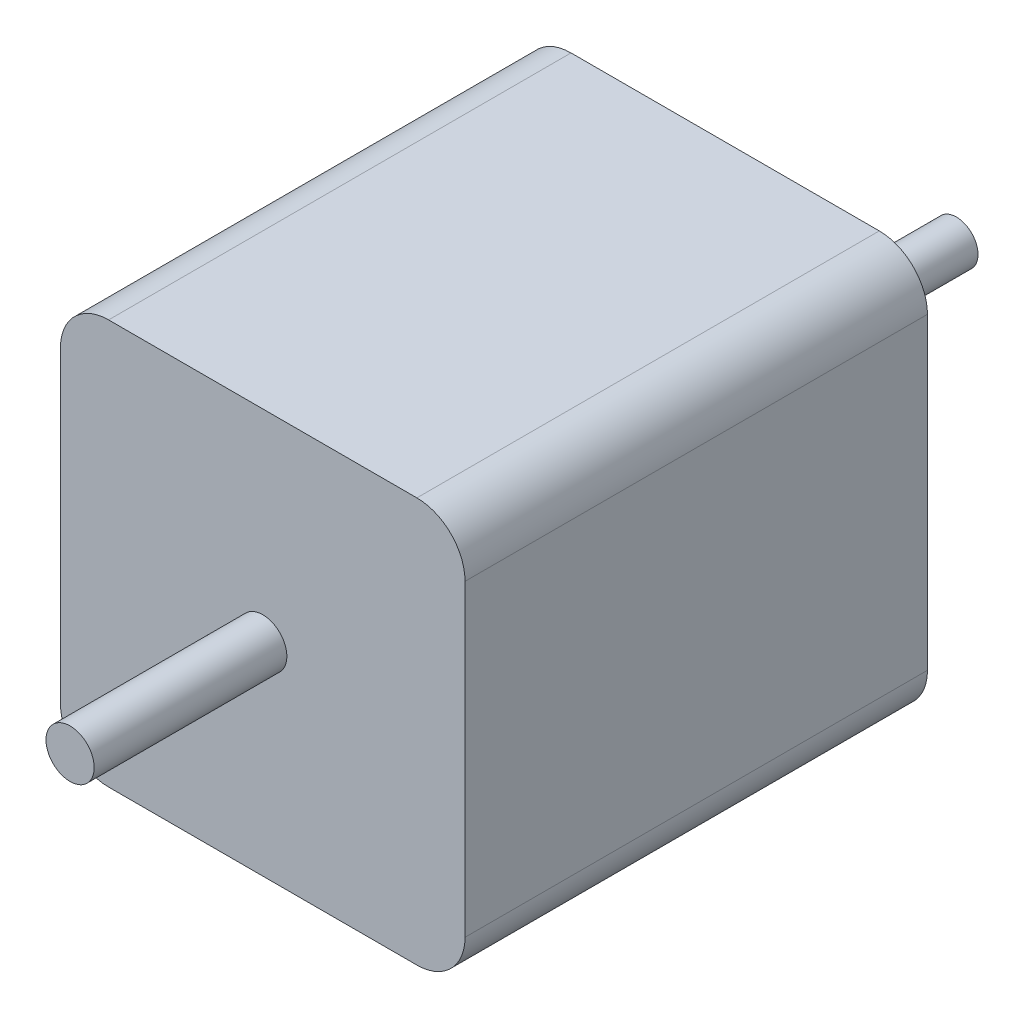
ISO-10303-21;
HEADER;
FILE_DESCRIPTION(('STEP AP214'),'2;1');
FILE_NAME('part.step','',(''),(''),'','','');
FILE_SCHEMA(('AUTOMOTIVE_DESIGN { 1 0 10303 214 1 1 1 1 }'));
ENDSEC;
DATA;
#1=APPLICATION_CONTEXT('core data for automotive mechanical design processes');
#2=APPLICATION_PROTOCOL_DEFINITION('international standard','automotive_design',2000,#1);
#3=PRODUCT_CONTEXT('',#1,'mechanical');
#4=PRODUCT('Part','Part','',(#3));
#5=PRODUCT_RELATED_PRODUCT_CATEGORY('part','',(#4));
#6=PRODUCT_DEFINITION_FORMATION('','',#4);
#7=PRODUCT_DEFINITION_CONTEXT('part definition',#1,'design');
#8=PRODUCT_DEFINITION('design','',#6,#7);
#9=PRODUCT_DEFINITION_SHAPE('','',#8);
#10=(LENGTH_UNIT() NAMED_UNIT(*) SI_UNIT(.MILLI.,.METRE.));
#11=(NAMED_UNIT(*) PLANE_ANGLE_UNIT() SI_UNIT($,.RADIAN.));
#12=(NAMED_UNIT(*) SI_UNIT($,.STERADIAN.) SOLID_ANGLE_UNIT());
#13=UNCERTAINTY_MEASURE_WITH_UNIT(LENGTH_MEASURE(1.E-05),#10,'distance_accuracy_value','');
#14=(GEOMETRIC_REPRESENTATION_CONTEXT(3) GLOBAL_UNCERTAINTY_ASSIGNED_CONTEXT((#13)) GLOBAL_UNIT_ASSIGNED_CONTEXT((#10,
#11,#12)) REPRESENTATION_CONTEXT('',''));
#15=CARTESIAN_POINT('',(0.,0.,0.));
#16=DIRECTION('',(0.,0.,1.));
#17=DIRECTION('',(1.,0.,0.));
#18=AXIS2_PLACEMENT_3D('',#15,#16,#17);
#19=CARTESIAN_POINT('',(21.,-21.,48.));
#20=DIRECTION('',(-1.,0.,0.));
#21=DIRECTION('',(0.,0.,1.));
#22=AXIS2_PLACEMENT_3D('',#19,#20,#21);
#23=PLANE('',#22);
#24=DIRECTION('',(0.,1.,0.));
#25=VECTOR('',#24,1.);
#26=CARTESIAN_POINT('',(21.,-21.,48.));
#27=LINE('',#26,#25);
#28=CARTESIAN_POINT('',(21.,-16.,48.));
#29=VERTEX_POINT('',#28);
#30=CARTESIAN_POINT('',(21.,16.,48.));
#31=VERTEX_POINT('',#30);
#32=EDGE_CURVE('E143',#29,#31,#27,.T.);
#33=ORIENTED_EDGE('',*,*,#32,.F.);
#34=DIRECTION('',(0.,0.,-1.));
#35=VECTOR('',#34,1.);
#36=CARTESIAN_POINT('',(21.,-16.,48.));
#37=LINE('',#36,#35);
#38=CARTESIAN_POINT('',(21.,-16.,0.));
#39=VERTEX_POINT('',#38);
#40=EDGE_CURVE('E183',#29,#39,#37,.T.);
#41=ORIENTED_EDGE('',*,*,#40,.T.);
#42=DIRECTION('',(0.,1.,0.));
#43=VECTOR('',#42,1.);
#44=CARTESIAN_POINT('',(21.,-21.,0.));
#45=LINE('',#44,#43);
#46=CARTESIAN_POINT('',(21.,16.,0.));
#47=VERTEX_POINT('',#46);
#48=EDGE_CURVE('E196',#39,#47,#45,.T.);
#49=ORIENTED_EDGE('',*,*,#48,.T.);
#50=DIRECTION('',(0.,0.,-1.));
#51=VECTOR('',#50,1.);
#52=CARTESIAN_POINT('',(21.,16.,48.));
#53=LINE('',#52,#51);
#54=EDGE_CURVE('E180',#47,#31,#53,.F.);
#55=ORIENTED_EDGE('',*,*,#54,.T.);
#56=EDGE_LOOP('',(#33,#41,#49,#55));
#57=FACE_BOUND('',#56,.T.);
#58=ADVANCED_FACE('F46',(#57),#23,.F.);
#59=CARTESIAN_POINT('',(-21.,21.,48.));
#60=DIRECTION('',(0.,-1.,0.));
#61=DIRECTION('',(0.,0.,-1.));
#62=AXIS2_PLACEMENT_3D('',#59,#60,#61);
#63=PLANE('',#62);
#64=DIRECTION('',(-1.,0.,0.));
#65=VECTOR('',#64,1.);
#66=CARTESIAN_POINT('',(-21.,21.,48.));
#67=LINE('',#66,#65);
#68=CARTESIAN_POINT('',(16.,21.,48.));
#69=VERTEX_POINT('',#68);
#70=CARTESIAN_POINT('',(-16.,21.,48.));
#71=VERTEX_POINT('',#70);
#72=EDGE_CURVE('E148',#69,#71,#67,.T.);
#73=ORIENTED_EDGE('',*,*,#72,.F.);
#74=DIRECTION('',(0.,0.,-1.));
#75=VECTOR('',#74,1.);
#76=CARTESIAN_POINT('',(16.,21.,48.));
#77=LINE('',#76,#75);
#78=CARTESIAN_POINT('',(16.,21.,0.));
#79=VERTEX_POINT('',#78);
#80=EDGE_CURVE('E55',#69,#79,#77,.T.);
#81=ORIENTED_EDGE('',*,*,#80,.T.);
#82=DIRECTION('',(-1.,0.,0.));
#83=VECTOR('',#82,1.);
#84=CARTESIAN_POINT('',(-21.,21.,0.));
#85=LINE('',#84,#83);
#86=CARTESIAN_POINT('',(-16.,21.,0.));
#87=VERTEX_POINT('',#86);
#88=EDGE_CURVE('E150',#79,#87,#85,.T.);
#89=ORIENTED_EDGE('',*,*,#88,.T.);
#90=DIRECTION('',(0.,0.,-1.));
#91=VECTOR('',#90,1.);
#92=CARTESIAN_POINT('',(-16.,21.,48.));
#93=LINE('',#92,#91);
#94=EDGE_CURVE('E62',#87,#71,#93,.F.);
#95=ORIENTED_EDGE('',*,*,#94,.T.);
#96=EDGE_LOOP('',(#73,#81,#89,#95));
#97=FACE_BOUND('',#96,.T.);
#98=ADVANCED_FACE('F192',(#97),#63,.F.);
#99=CARTESIAN_POINT('',(-21.,-21.,48.));
#100=DIRECTION('',(1.,0.,0.));
#101=DIRECTION('',(0.,0.,-1.));
#102=AXIS2_PLACEMENT_3D('',#99,#100,#101);
#103=PLANE('',#102);
#104=DIRECTION('',(0.,-1.,0.));
#105=VECTOR('',#104,1.);
#106=CARTESIAN_POINT('',(-21.,-21.,0.));
#107=LINE('',#106,#105);
#108=CARTESIAN_POINT('',(-21.,16.,0.));
#109=VERTEX_POINT('',#108);
#110=CARTESIAN_POINT('',(-21.,-16.,0.));
#111=VERTEX_POINT('',#110);
#112=EDGE_CURVE('E144',#109,#111,#107,.T.);
#113=ORIENTED_EDGE('',*,*,#112,.T.);
#114=DIRECTION('',(0.,0.,-1.));
#115=VECTOR('',#114,1.);
#116=CARTESIAN_POINT('',(-21.,-16.,48.));
#117=LINE('',#116,#115);
#118=CARTESIAN_POINT('',(-21.,-16.,48.));
#119=VERTEX_POINT('',#118);
#120=EDGE_CURVE('E119',#111,#119,#117,.F.);
#121=ORIENTED_EDGE('',*,*,#120,.T.);
#122=DIRECTION('',(0.,-1.,0.));
#123=VECTOR('',#122,1.);
#124=CARTESIAN_POINT('',(-21.,-21.,48.));
#125=LINE('',#124,#123);
#126=CARTESIAN_POINT('',(-21.,16.,48.));
#127=VERTEX_POINT('',#126);
#128=EDGE_CURVE('E204',#127,#119,#125,.T.);
#129=ORIENTED_EDGE('',*,*,#128,.F.);
#130=DIRECTION('',(0.,0.,-1.));
#131=VECTOR('',#130,1.);
#132=CARTESIAN_POINT('',(-21.,16.,48.));
#133=LINE('',#132,#131);
#134=EDGE_CURVE('E125',#127,#109,#133,.T.);
#135=ORIENTED_EDGE('',*,*,#134,.T.);
#136=EDGE_LOOP('',(#113,#121,#129,#135));
#137=FACE_BOUND('',#136,.T.);
#138=ADVANCED_FACE('F305',(#137),#103,.F.);
#139=CARTESIAN_POINT('',(-21.,-21.,48.));
#140=DIRECTION('',(0.,1.,0.));
#141=DIRECTION('',(0.,0.,1.));
#142=AXIS2_PLACEMENT_3D('',#139,#140,#141);
#143=PLANE('',#142);
#144=DIRECTION('',(1.,0.,0.));
#145=VECTOR('',#144,1.);
#146=CARTESIAN_POINT('',(-21.,-21.,48.));
#147=LINE('',#146,#145);
#148=CARTESIAN_POINT('',(-16.,-21.,48.));
#149=VERTEX_POINT('',#148);
#150=CARTESIAN_POINT('',(16.,-21.,48.));
#151=VERTEX_POINT('',#150);
#152=EDGE_CURVE('E135',#149,#151,#147,.T.);
#153=ORIENTED_EDGE('',*,*,#152,.F.);
#154=DIRECTION('',(0.,0.,-1.));
#155=VECTOR('',#154,1.);
#156=CARTESIAN_POINT('',(-16.,-21.,48.));
#157=LINE('',#156,#155);
#158=CARTESIAN_POINT('',(-16.,-21.,0.));
#159=VERTEX_POINT('',#158);
#160=EDGE_CURVE('E118',#149,#159,#157,.T.);
#161=ORIENTED_EDGE('',*,*,#160,.T.);
#162=DIRECTION('',(1.,0.,0.));
#163=VECTOR('',#162,1.);
#164=CARTESIAN_POINT('',(-21.,-21.,0.));
#165=LINE('',#164,#163);
#166=CARTESIAN_POINT('',(16.,-21.,0.));
#167=VERTEX_POINT('',#166);
#168=EDGE_CURVE('E132',#159,#167,#165,.T.);
#169=ORIENTED_EDGE('',*,*,#168,.T.);
#170=DIRECTION('',(0.,0.,-1.));
#171=VECTOR('',#170,1.);
#172=CARTESIAN_POINT('',(16.,-21.,48.));
#173=LINE('',#172,#171);
#174=EDGE_CURVE('E138',#167,#151,#173,.F.);
#175=ORIENTED_EDGE('',*,*,#174,.T.);
#176=EDGE_LOOP('',(#153,#161,#169,#175));
#177=FACE_BOUND('',#176,.T.);
#178=ADVANCED_FACE('F131',(#177),#143,.F.);
#179=CARTESIAN_POINT('',(0.,0.,48.));
#180=DIRECTION('',(0.,0.,-1.));
#181=DIRECTION('',(-1.,0.,0.));
#182=AXIS2_PLACEMENT_3D('',#179,#180,#181);
#183=PLANE('',#182);
#184=CARTESIAN_POINT('',(0.,0.,48.));
#185=DIRECTION('',(0.,0.,-1.));
#186=DIRECTION('',(-1.,0.,0.));
#187=AXIS2_PLACEMENT_3D('',#184,#185,#186);
#188=CIRCLE('',#187,2.5);
#189=CARTESIAN_POINT('',(-2.5,0.,48.));
#190=VERTEX_POINT('',#189);
#191=EDGE_CURVE('E12',#190,#190,#188,.F.);
#192=ORIENTED_EDGE('',*,*,#191,.F.);
#193=EDGE_LOOP('',(#192));
#194=FACE_BOUND('',#193,.T.);
#195=ORIENTED_EDGE('',*,*,#128,.T.);
#196=CARTESIAN_POINT('',(-16.,-16.,48.));
#197=DIRECTION('',(0.,0.,-1.));
#198=DIRECTION('',(-1.,0.,0.));
#199=AXIS2_PLACEMENT_3D('',#196,#197,#198);
#200=CIRCLE('',#199,5.);
#201=EDGE_CURVE('E177',#119,#149,#200,.F.);
#202=ORIENTED_EDGE('',*,*,#201,.T.);
#203=ORIENTED_EDGE('',*,*,#152,.T.);
#204=CARTESIAN_POINT('',(16.,-16.,48.));
#205=DIRECTION('',(0.,0.,-1.));
#206=DIRECTION('',(-1.,0.,0.));
#207=AXIS2_PLACEMENT_3D('',#204,#205,#206);
#208=CIRCLE('',#207,5.);
#209=EDGE_CURVE('E174',#151,#29,#208,.F.);
#210=ORIENTED_EDGE('',*,*,#209,.T.);
#211=ORIENTED_EDGE('',*,*,#32,.T.);
#212=CARTESIAN_POINT('',(16.,16.,48.));
#213=DIRECTION('',(0.,0.,-1.));
#214=DIRECTION('',(-1.,0.,0.));
#215=AXIS2_PLACEMENT_3D('',#212,#213,#214);
#216=CIRCLE('',#215,5.);
#217=EDGE_CURVE('E69',#31,#69,#216,.F.);
#218=ORIENTED_EDGE('',*,*,#217,.T.);
#219=ORIENTED_EDGE('',*,*,#72,.T.);
#220=CARTESIAN_POINT('',(-16.,16.,48.));
#221=DIRECTION('',(0.,0.,-1.));
#222=DIRECTION('',(-1.,0.,0.));
#223=AXIS2_PLACEMENT_3D('',#220,#221,#222);
#224=CIRCLE('',#223,5.);
#225=EDGE_CURVE('E169',#71,#127,#224,.F.);
#226=ORIENTED_EDGE('',*,*,#225,.T.);
#227=EDGE_LOOP('',(#195,#202,#203,#210,#211,#218,#219,#226));
#228=FACE_BOUND('',#227,.T.);
#229=ADVANCED_FACE('F280',(#194,#228),#183,.F.);
#230=CARTESIAN_POINT('',(0.,0.,0.));
#231=DIRECTION('',(0.,0.,-1.));
#232=DIRECTION('',(-1.,0.,0.));
#233=AXIS2_PLACEMENT_3D('',#230,#231,#232);
#234=PLANE('',#233);
#235=CARTESIAN_POINT('',(15.4999999999991,-15.5,0.));
#236=DIRECTION('',(0.,0.,-1.));
#237=DIRECTION('',(-1.,0.,0.));
#238=AXIS2_PLACEMENT_3D('',#235,#236,#237);
#239=CIRCLE('',#238,1.5);
#240=CARTESIAN_POINT('',(13.9999999999991,-15.5,0.));
#241=VERTEX_POINT('',#240);
#242=EDGE_CURVE('E232',#241,#241,#239,.T.);
#243=ORIENTED_EDGE('',*,*,#242,.F.);
#244=EDGE_LOOP('',(#243));
#245=FACE_BOUND('',#244,.T.);
#246=CARTESIAN_POINT('',(-15.5000000000009,-15.4999999999991,0.));
#247=DIRECTION('',(0.,0.,-1.));
#248=DIRECTION('',(-1.,0.,0.));
#249=AXIS2_PLACEMENT_3D('',#246,#247,#248);
#250=CIRCLE('',#249,1.5);
#251=CARTESIAN_POINT('',(-17.0000000000009,-15.4999999999991,0.));
#252=VERTEX_POINT('',#251);
#253=EDGE_CURVE('E256',#252,#252,#250,.T.);
#254=ORIENTED_EDGE('',*,*,#253,.F.);
#255=EDGE_LOOP('',(#254));
#256=FACE_BOUND('',#255,.T.);
#257=CARTESIAN_POINT('',(-15.5,15.5000000000009,0.));
#258=DIRECTION('',(0.,0.,-1.));
#259=DIRECTION('',(-1.,0.,0.));
#260=AXIS2_PLACEMENT_3D('',#257,#258,#259);
#261=CIRCLE('',#260,1.5);
#262=CARTESIAN_POINT('',(-17.,15.5000000000009,0.));
#263=VERTEX_POINT('',#262);
#264=EDGE_CURVE('E248',#263,#263,#261,.T.);
#265=ORIENTED_EDGE('',*,*,#264,.F.);
#266=EDGE_LOOP('',(#265));
#267=FACE_BOUND('',#266,.T.);
#268=CARTESIAN_POINT('',(15.5,15.5,0.));
#269=DIRECTION('',(0.,0.,-1.));
#270=DIRECTION('',(-1.,0.,0.));
#271=AXIS2_PLACEMENT_3D('',#268,#269,#270);
#272=CIRCLE('',#271,1.5);
#273=CARTESIAN_POINT('',(14.,15.5,0.));
#274=VERTEX_POINT('',#273);
#275=EDGE_CURVE('E224',#274,#274,#272,.T.);
#276=ORIENTED_EDGE('',*,*,#275,.F.);
#277=EDGE_LOOP('',(#276));
#278=FACE_BOUND('',#277,.T.);
#279=CARTESIAN_POINT('',(0.,0.,0.));
#280=DIRECTION('',(0.,0.,-1.));
#281=DIRECTION('',(-1.,0.,0.));
#282=AXIS2_PLACEMENT_3D('',#279,#280,#281);
#283=CIRCLE('',#282,11.);
#284=CARTESIAN_POINT('',(-11.,0.,0.));
#285=VERTEX_POINT('',#284);
#286=EDGE_CURVE('E203',#285,#285,#283,.T.);
#287=ORIENTED_EDGE('',*,*,#286,.F.);
#288=EDGE_LOOP('',(#287));
#289=FACE_BOUND('',#288,.T.);
#290=ORIENTED_EDGE('',*,*,#168,.F.);
#291=CARTESIAN_POINT('',(-16.,-16.,0.));
#292=DIRECTION('',(0.,0.,-1.));
#293=DIRECTION('',(-1.,0.,0.));
#294=AXIS2_PLACEMENT_3D('',#291,#292,#293);
#295=CIRCLE('',#294,5.);
#296=EDGE_CURVE('E114',#159,#111,#295,.T.);
#297=ORIENTED_EDGE('',*,*,#296,.T.);
#298=ORIENTED_EDGE('',*,*,#112,.F.);
#299=CARTESIAN_POINT('',(-16.,16.,0.));
#300=DIRECTION('',(0.,0.,-1.));
#301=DIRECTION('',(-1.,0.,0.));
#302=AXIS2_PLACEMENT_3D('',#299,#300,#301);
#303=CIRCLE('',#302,5.);
#304=EDGE_CURVE('E137',#109,#87,#303,.T.);
#305=ORIENTED_EDGE('',*,*,#304,.T.);
#306=ORIENTED_EDGE('',*,*,#88,.F.);
#307=CARTESIAN_POINT('',(16.,16.,0.));
#308=DIRECTION('',(0.,0.,-1.));
#309=DIRECTION('',(-1.,0.,0.));
#310=AXIS2_PLACEMENT_3D('',#307,#308,#309);
#311=CIRCLE('',#310,5.);
#312=EDGE_CURVE('E159',#79,#47,#311,.T.);
#313=ORIENTED_EDGE('',*,*,#312,.T.);
#314=ORIENTED_EDGE('',*,*,#48,.F.);
#315=CARTESIAN_POINT('',(16.,-16.,0.));
#316=DIRECTION('',(0.,0.,-1.));
#317=DIRECTION('',(-1.,0.,0.));
#318=AXIS2_PLACEMENT_3D('',#315,#316,#317);
#319=CIRCLE('',#318,5.);
#320=EDGE_CURVE('E126',#39,#167,#319,.T.);
#321=ORIENTED_EDGE('',*,*,#320,.T.);
#322=EDGE_LOOP('',(#290,#297,#298,#305,#306,#313,#314,#321));
#323=FACE_BOUND('',#322,.T.);
#324=ADVANCED_FACE('F140',(#245,#256,#267,#278,#289,#323),#234,.T.);
#325=CARTESIAN_POINT('',(0.,0.,-2.));
#326=DIRECTION('',(0.,0.,1.));
#327=DIRECTION('',(1.,0.,0.));
#328=AXIS2_PLACEMENT_3D('',#325,#326,#327);
#329=CYLINDRICAL_SURFACE('',#328,11.);
#330=CARTESIAN_POINT('',(0.,0.,-2.));
#331=DIRECTION('',(0.,0.,-1.));
#332=DIRECTION('',(-1.,0.,0.));
#333=AXIS2_PLACEMENT_3D('',#330,#331,#332);
#334=CIRCLE('',#333,11.);
#335=CARTESIAN_POINT('',(-11.,0.,-2.));
#336=VERTEX_POINT('',#335);
#337=EDGE_CURVE('E198',#336,#336,#334,.T.);
#338=ORIENTED_EDGE('',*,*,#337,.F.);
#339=EDGE_LOOP('',(#338));
#340=FACE_BOUND('',#339,.T.);
#341=ORIENTED_EDGE('',*,*,#286,.T.);
#342=EDGE_LOOP('',(#341));
#343=FACE_BOUND('',#342,.T.);
#344=ADVANCED_FACE('F279',(#340,#343),#329,.T.);
#345=CARTESIAN_POINT('',(0.,0.,-2.));
#346=DIRECTION('',(0.,0.,-1.));
#347=DIRECTION('',(-1.,0.,0.));
#348=AXIS2_PLACEMENT_3D('',#345,#346,#347);
#349=PLANE('',#348);
#350=CARTESIAN_POINT('',(0.,0.,-2.));
#351=DIRECTION('',(0.,0.,-1.));
#352=DIRECTION('',(-1.,0.,0.));
#353=AXIS2_PLACEMENT_3D('',#350,#351,#352);
#354=CIRCLE('',#353,2.25);
#355=CARTESIAN_POINT('',(-2.25,0.,-2.));
#356=VERTEX_POINT('',#355);
#357=EDGE_CURVE('E155',#356,#356,#354,.T.);
#358=ORIENTED_EDGE('',*,*,#357,.F.);
#359=EDGE_LOOP('',(#358));
#360=FACE_BOUND('',#359,.T.);
#361=ORIENTED_EDGE('',*,*,#337,.T.);
#362=EDGE_LOOP('',(#361));
#363=FACE_BOUND('',#362,.T.);
#364=ADVANCED_FACE('F288',(#360,#363),#349,.T.);
#365=CARTESIAN_POINT('',(0.,0.,-24.));
#366=DIRECTION('',(0.,0.,1.));
#367=DIRECTION('',(1.,0.,0.));
#368=AXIS2_PLACEMENT_3D('',#365,#366,#367);
#369=CYLINDRICAL_SURFACE('',#368,2.25);
#370=CARTESIAN_POINT('',(0.,0.,-24.));
#371=DIRECTION('',(0.,0.,-1.));
#372=DIRECTION('',(-1.,0.,0.));
#373=AXIS2_PLACEMENT_3D('',#370,#371,#372);
#374=CIRCLE('',#373,2.25);
#375=CARTESIAN_POINT('',(-2.25,0.,-24.));
#376=VERTEX_POINT('',#375);
#377=EDGE_CURVE('E216',#376,#376,#374,.T.);
#378=ORIENTED_EDGE('',*,*,#377,.F.);
#379=EDGE_LOOP('',(#378));
#380=FACE_BOUND('',#379,.T.);
#381=ORIENTED_EDGE('',*,*,#357,.T.);
#382=EDGE_LOOP('',(#381));
#383=FACE_BOUND('',#382,.T.);
#384=ADVANCED_FACE('F294',(#380,#383),#369,.T.);
#385=CARTESIAN_POINT('',(0.,0.,-24.));
#386=DIRECTION('',(0.,0.,-1.));
#387=DIRECTION('',(-1.,0.,0.));
#388=AXIS2_PLACEMENT_3D('',#385,#386,#387);
#389=PLANE('',#388);
#390=ORIENTED_EDGE('',*,*,#377,.T.);
#391=EDGE_LOOP('',(#390));
#392=FACE_BOUND('',#391,.T.);
#393=ADVANCED_FACE('F381',(#392),#389,.T.);
#394=CARTESIAN_POINT('',(15.5,15.5,4.5));
#395=DIRECTION('',(0.,0.,-1.));
#396=DIRECTION('',(-1.,0.,0.));
#397=AXIS2_PLACEMENT_3D('',#394,#395,#396);
#398=CYLINDRICAL_SURFACE('',#397,1.5);
#399=CARTESIAN_POINT('',(15.5,15.5,4.5));
#400=DIRECTION('',(0.,0.,-1.));
#401=DIRECTION('',(-1.,0.,0.));
#402=AXIS2_PLACEMENT_3D('',#399,#400,#401);
#403=CIRCLE('',#402,1.5);
#404=CARTESIAN_POINT('',(14.,15.5,4.5));
#405=VERTEX_POINT('',#404);
#406=EDGE_CURVE('E223',#405,#405,#403,.T.);
#407=ORIENTED_EDGE('',*,*,#406,.F.);
#408=EDGE_LOOP('',(#407));
#409=FACE_BOUND('',#408,.T.);
#410=ORIENTED_EDGE('',*,*,#275,.T.);
#411=EDGE_LOOP('',(#410));
#412=FACE_BOUND('',#411,.T.);
#413=ADVANCED_FACE('F377',(#409,#412),#398,.F.);
#414=CARTESIAN_POINT('',(15.5,15.5,4.5));
#415=DIRECTION('',(0.,0.,-1.));
#416=DIRECTION('',(-1.,0.,0.));
#417=AXIS2_PLACEMENT_3D('',#414,#415,#416);
#418=PLANE('',#417);
#419=ORIENTED_EDGE('',*,*,#406,.T.);
#420=EDGE_LOOP('',(#419));
#421=FACE_BOUND('',#420,.T.);
#422=ADVANCED_FACE('F360',(#421),#418,.T.);
#423=CARTESIAN_POINT('',(-15.5,15.5000000000009,4.5));
#424=DIRECTION('',(0.,0.,-1.));
#425=DIRECTION('',(-1.,0.,0.));
#426=AXIS2_PLACEMENT_3D('',#423,#424,#425);
#427=CYLINDRICAL_SURFACE('',#426,1.5);
#428=CARTESIAN_POINT('',(-15.5,15.5000000000009,4.5));
#429=DIRECTION('',(0.,0.,-1.));
#430=DIRECTION('',(-1.,0.,0.));
#431=AXIS2_PLACEMENT_3D('',#428,#429,#430);
#432=CIRCLE('',#431,1.5);
#433=CARTESIAN_POINT('',(-17.,15.5000000000009,4.5));
#434=VERTEX_POINT('',#433);
#435=EDGE_CURVE('E227',#434,#434,#432,.T.);
#436=ORIENTED_EDGE('',*,*,#435,.F.);
#437=EDGE_LOOP('',(#436));
#438=FACE_BOUND('',#437,.T.);
#439=ORIENTED_EDGE('',*,*,#264,.T.);
#440=EDGE_LOOP('',(#439));
#441=FACE_BOUND('',#440,.T.);
#442=ADVANCED_FACE('F275',(#438,#441),#427,.F.);
#443=CARTESIAN_POINT('',(-15.5,15.5000000000009,4.5));
#444=DIRECTION('',(0.,0.,-1.));
#445=DIRECTION('',(-1.,0.,0.));
#446=AXIS2_PLACEMENT_3D('',#443,#444,#445);
#447=PLANE('',#446);
#448=ORIENTED_EDGE('',*,*,#435,.T.);
#449=EDGE_LOOP('',(#448));
#450=FACE_BOUND('',#449,.T.);
#451=ADVANCED_FACE('F353',(#450),#447,.T.);
#452=CARTESIAN_POINT('',(-15.5000000000009,-15.4999999999991,4.5));
#453=DIRECTION('',(0.,0.,-1.));
#454=DIRECTION('',(-1.,0.,0.));
#455=AXIS2_PLACEMENT_3D('',#452,#453,#454);
#456=CYLINDRICAL_SURFACE('',#455,1.5);
#457=CARTESIAN_POINT('',(-15.5000000000009,-15.4999999999991,4.5));
#458=DIRECTION('',(0.,0.,-1.));
#459=DIRECTION('',(-1.,0.,0.));
#460=AXIS2_PLACEMENT_3D('',#457,#458,#459);
#461=CIRCLE('',#460,1.5);
#462=CARTESIAN_POINT('',(-17.0000000000009,-15.4999999999991,4.5));
#463=VERTEX_POINT('',#462);
#464=EDGE_CURVE('E260',#463,#463,#461,.T.);
#465=ORIENTED_EDGE('',*,*,#464,.F.);
#466=EDGE_LOOP('',(#465));
#467=FACE_BOUND('',#466,.T.);
#468=ORIENTED_EDGE('',*,*,#253,.T.);
#469=EDGE_LOOP('',(#468));
#470=FACE_BOUND('',#469,.T.);
#471=ADVANCED_FACE('F356',(#467,#470),#456,.F.);
#472=CARTESIAN_POINT('',(-15.5000000000009,-15.4999999999991,4.5));
#473=DIRECTION('',(0.,0.,-1.));
#474=DIRECTION('',(-1.,0.,0.));
#475=AXIS2_PLACEMENT_3D('',#472,#473,#474);
#476=PLANE('',#475);
#477=ORIENTED_EDGE('',*,*,#464,.T.);
#478=EDGE_LOOP('',(#477));
#479=FACE_BOUND('',#478,.T.);
#480=ADVANCED_FACE('F362',(#479),#476,.T.);
#481=CARTESIAN_POINT('',(15.4999999999991,-15.5,4.5));
#482=DIRECTION('',(0.,0.,-1.));
#483=DIRECTION('',(-1.,0.,0.));
#484=AXIS2_PLACEMENT_3D('',#481,#482,#483);
#485=CYLINDRICAL_SURFACE('',#484,1.5);
#486=CARTESIAN_POINT('',(15.4999999999991,-15.5,4.5));
#487=DIRECTION('',(0.,0.,-1.));
#488=DIRECTION('',(-1.,0.,0.));
#489=AXIS2_PLACEMENT_3D('',#486,#487,#488);
#490=CIRCLE('',#489,1.5);
#491=CARTESIAN_POINT('',(13.9999999999991,-15.5,4.5));
#492=VERTEX_POINT('',#491);
#493=EDGE_CURVE('E251',#492,#492,#490,.T.);
#494=ORIENTED_EDGE('',*,*,#493,.F.);
#495=EDGE_LOOP('',(#494));
#496=FACE_BOUND('',#495,.T.);
#497=ORIENTED_EDGE('',*,*,#242,.T.);
#498=EDGE_LOOP('',(#497));
#499=FACE_BOUND('',#498,.T.);
#500=ADVANCED_FACE('F365',(#496,#499),#485,.F.);
#501=CARTESIAN_POINT('',(15.4999999999991,-15.5,4.5));
#502=DIRECTION('',(0.,0.,-1.));
#503=DIRECTION('',(-1.,0.,0.));
#504=AXIS2_PLACEMENT_3D('',#501,#502,#503);
#505=PLANE('',#504);
#506=ORIENTED_EDGE('',*,*,#493,.T.);
#507=EDGE_LOOP('',(#506));
#508=FACE_BOUND('',#507,.T.);
#509=ADVANCED_FACE('F313',(#508),#505,.T.);
#510=CARTESIAN_POINT('',(-16.,-16.,48.));
#511=DIRECTION('',(0.,0.,-1.));
#512=DIRECTION('',(-1.,0.,0.));
#513=AXIS2_PLACEMENT_3D('',#510,#511,#512);
#514=CYLINDRICAL_SURFACE('',#513,5.);
#515=ORIENTED_EDGE('',*,*,#201,.F.);
#516=ORIENTED_EDGE('',*,*,#120,.F.);
#517=ORIENTED_EDGE('',*,*,#296,.F.);
#518=ORIENTED_EDGE('',*,*,#160,.F.);
#519=EDGE_LOOP('',(#515,#516,#517,#518));
#520=FACE_BOUND('',#519,.T.);
#521=ADVANCED_FACE('F117',(#520),#514,.T.);
#522=CARTESIAN_POINT('',(16.,-16.,48.));
#523=DIRECTION('',(0.,0.,-1.));
#524=DIRECTION('',(-1.,0.,0.));
#525=AXIS2_PLACEMENT_3D('',#522,#523,#524);
#526=CYLINDRICAL_SURFACE('',#525,5.);
#527=ORIENTED_EDGE('',*,*,#209,.F.);
#528=ORIENTED_EDGE('',*,*,#174,.F.);
#529=ORIENTED_EDGE('',*,*,#320,.F.);
#530=ORIENTED_EDGE('',*,*,#40,.F.);
#531=EDGE_LOOP('',(#527,#528,#529,#530));
#532=FACE_BOUND('',#531,.T.);
#533=ADVANCED_FACE('F312',(#532),#526,.T.);
#534=CARTESIAN_POINT('',(16.,16.,48.));
#535=DIRECTION('',(0.,0.,-1.));
#536=DIRECTION('',(-1.,0.,0.));
#537=AXIS2_PLACEMENT_3D('',#534,#535,#536);
#538=CYLINDRICAL_SURFACE('',#537,5.);
#539=ORIENTED_EDGE('',*,*,#217,.F.);
#540=ORIENTED_EDGE('',*,*,#54,.F.);
#541=ORIENTED_EDGE('',*,*,#312,.F.);
#542=ORIENTED_EDGE('',*,*,#80,.F.);
#543=EDGE_LOOP('',(#539,#540,#541,#542));
#544=FACE_BOUND('',#543,.T.);
#545=ADVANCED_FACE('F315',(#544),#538,.T.);
#546=CARTESIAN_POINT('',(-16.,16.,48.));
#547=DIRECTION('',(0.,0.,-1.));
#548=DIRECTION('',(-1.,0.,0.));
#549=AXIS2_PLACEMENT_3D('',#546,#547,#548);
#550=CYLINDRICAL_SURFACE('',#549,5.);
#551=ORIENTED_EDGE('',*,*,#225,.F.);
#552=ORIENTED_EDGE('',*,*,#94,.F.);
#553=ORIENTED_EDGE('',*,*,#304,.F.);
#554=ORIENTED_EDGE('',*,*,#134,.F.);
#555=EDGE_LOOP('',(#551,#552,#553,#554));
#556=FACE_BOUND('',#555,.T.);
#557=ADVANCED_FACE('F48',(#556),#550,.T.);
#558=CARTESIAN_POINT('',(0.,0.,68.));
#559=DIRECTION('',(0.,0.,-1.));
#560=DIRECTION('',(-1.,0.,0.));
#561=AXIS2_PLACEMENT_3D('',#558,#559,#560);
#562=CYLINDRICAL_SURFACE('',#561,2.5);
#563=CARTESIAN_POINT('',(0.,0.,68.));
#564=DIRECTION('',(0.,0.,1.));
#565=DIRECTION('',(1.,0.,0.));
#566=AXIS2_PLACEMENT_3D('',#563,#564,#565);
#567=CIRCLE('',#566,2.5);
#568=CARTESIAN_POINT('',(2.5,0.,68.));
#569=VERTEX_POINT('',#568);
#570=EDGE_CURVE('E249',#569,#569,#567,.T.);
#571=ORIENTED_EDGE('',*,*,#570,.F.);
#572=EDGE_LOOP('',(#571));
#573=FACE_BOUND('',#572,.T.);
#574=ORIENTED_EDGE('',*,*,#191,.T.);
#575=EDGE_LOOP('',(#574));
#576=FACE_BOUND('',#575,.T.);
#577=ADVANCED_FACE('F321',(#573,#576),#562,.T.);
#578=CARTESIAN_POINT('',(0.,0.,68.));
#579=DIRECTION('',(0.,0.,1.));
#580=DIRECTION('',(1.,0.,0.));
#581=AXIS2_PLACEMENT_3D('',#578,#579,#580);
#582=PLANE('',#581);
#583=ORIENTED_EDGE('',*,*,#570,.T.);
#584=EDGE_LOOP('',(#583));
#585=FACE_BOUND('',#584,.T.);
#586=ADVANCED_FACE('F344',(#585),#582,.T.);
#587=CLOSED_SHELL('',(#58,#98,#138,#178,#229,#324,#344,#364,#384,#393,#413,#422,#442,#451,#471,
#480,#500,#509,#521,#533,#545,#557,#577,#586));
#588=MANIFOLD_SOLID_BREP('B2',#587);
#589=ADVANCED_BREP_SHAPE_REPRESENTATION('',(#18,#588),#14);
#590=SHAPE_DEFINITION_REPRESENTATION(#9,#589);
ENDSEC;
END-ISO-10303-21;
